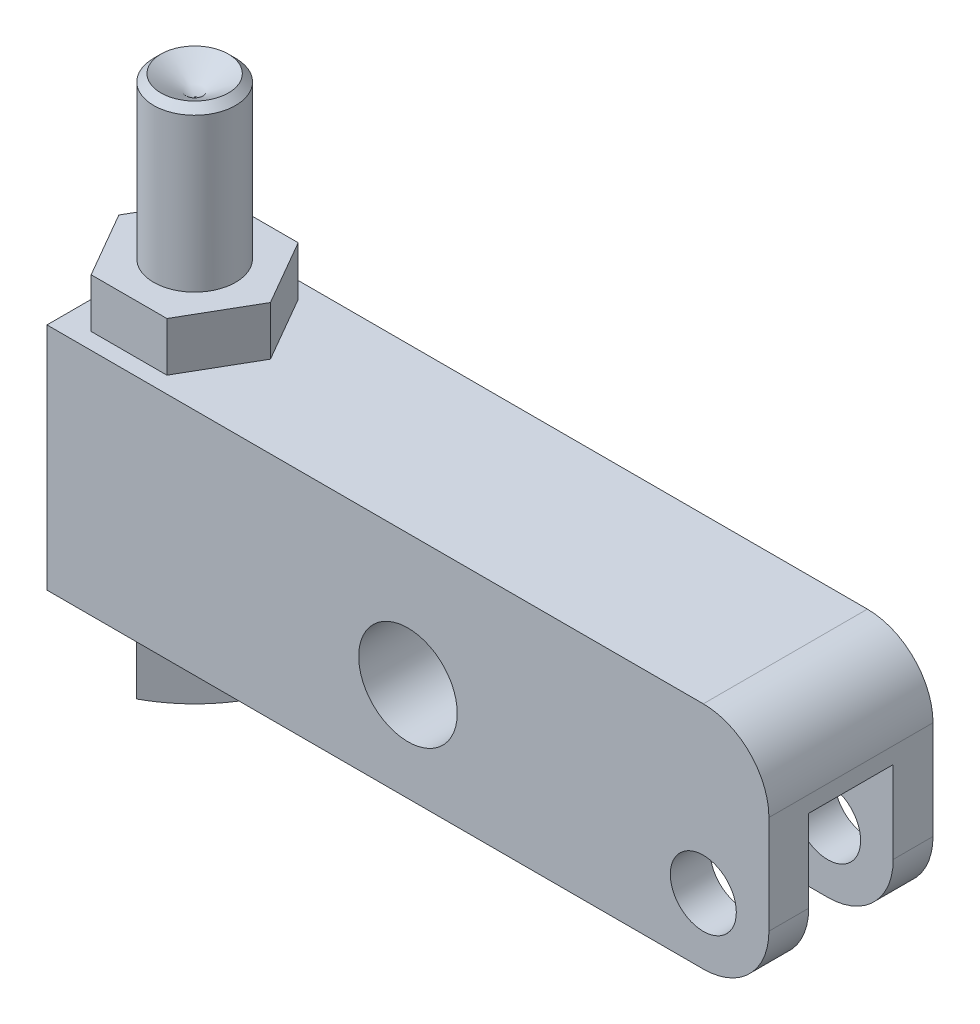
ISO-10303-21;
HEADER;
FILE_DESCRIPTION(('STEP AP214'),'2;1');
FILE_NAME('part.step','',(''),(''),'','','');
FILE_SCHEMA(('AUTOMOTIVE_DESIGN { 1 0 10303 214 1 1 1 1 }'));
ENDSEC;
DATA;
#1=APPLICATION_CONTEXT('core data for automotive mechanical design processes');
#2=APPLICATION_PROTOCOL_DEFINITION('international standard','automotive_design',2000,#1);
#3=PRODUCT_CONTEXT('',#1,'mechanical');
#4=PRODUCT('Part','Part','',(#3));
#5=PRODUCT_RELATED_PRODUCT_CATEGORY('part','',(#4));
#6=PRODUCT_DEFINITION_FORMATION('','',#4);
#7=PRODUCT_DEFINITION_CONTEXT('part definition',#1,'design');
#8=PRODUCT_DEFINITION('design','',#6,#7);
#9=PRODUCT_DEFINITION_SHAPE('','',#8);
#10=(LENGTH_UNIT() NAMED_UNIT(*) SI_UNIT(.MILLI.,.METRE.));
#11=(NAMED_UNIT(*) PLANE_ANGLE_UNIT() SI_UNIT($,.RADIAN.));
#12=(NAMED_UNIT(*) SI_UNIT($,.STERADIAN.) SOLID_ANGLE_UNIT());
#13=UNCERTAINTY_MEASURE_WITH_UNIT(LENGTH_MEASURE(1.E-05),#10,'distance_accuracy_value','');
#14=(GEOMETRIC_REPRESENTATION_CONTEXT(3) GLOBAL_UNCERTAINTY_ASSIGNED_CONTEXT((#13)) GLOBAL_UNIT_ASSIGNED_CONTEXT((#10,
#11,#12)) REPRESENTATION_CONTEXT('',''));
#15=CARTESIAN_POINT('',(0.,0.,0.));
#16=DIRECTION('',(0.,0.,1.));
#17=DIRECTION('',(1.,0.,0.));
#18=AXIS2_PLACEMENT_3D('',#15,#16,#17);
#19=CARTESIAN_POINT('',(-61.1124,-8.3058,0.));
#20=DIRECTION('',(0.,1.,0.));
#21=DIRECTION('',(-1.,0.,0.));
#22=AXIS2_PLACEMENT_3D('',#19,#20,#21);
#23=PLANE('',#22);
#24=DIRECTION('',(0.707106781186548,0.,0.707106781186547));
#25=VECTOR('',#24,1.);
#26=CARTESIAN_POINT('',(-62.7536798195471,-8.3058,0.));
#27=LINE('',#26,#25);
#28=CARTESIAN_POINT('',(-59.9518399097736,-8.3058,2.80183990977357));
#29=VERTEX_POINT('',#28);
#30=CARTESIAN_POINT('',(-57.15,-8.3058,5.60367981954715));
#31=VERTEX_POINT('',#30);
#32=EDGE_CURVE('E202',#29,#31,#27,.T.);
#33=ORIENTED_EDGE('',*,*,#32,.T.);
#34=DIRECTION('',(0.707106781186547,0.,-0.707106781186548));
#35=VECTOR('',#34,1.);
#36=CARTESIAN_POINT('',(-57.15,-8.3058,5.60367981954715));
#37=LINE('',#36,#35);
#38=CARTESIAN_POINT('',(-54.3481600902264,-8.3058,2.80183990977358));
#39=VERTEX_POINT('',#38);
#40=EDGE_CURVE('E211',#31,#39,#37,.T.);
#41=ORIENTED_EDGE('',*,*,#40,.T.);
#42=CARTESIAN_POINT('',(-57.15,-8.3058,0.));
#43=DIRECTION('',(0.,1.,0.));
#44=DIRECTION('',(-1.,0.,0.));
#45=AXIS2_PLACEMENT_3D('',#42,#43,#44);
#46=CIRCLE('',#45,3.96240000000001);
#47=EDGE_CURVE('E220',#29,#39,#46,.T.);
#48=ORIENTED_EDGE('',*,*,#47,.F.);
#49=EDGE_LOOP('',(#33,#41,#48));
#50=FACE_BOUND('',#49,.T.);
#51=ADVANCED_FACE('F35',(#50),#23,.T.);
#52=CARTESIAN_POINT('',(-54.3481600902264,-8.3058,-2.80183990977358));
#53=VERTEX_POINT('',#52);
#54=EDGE_CURVE('E234',#39,#53,#46,.T.);
#55=ORIENTED_EDGE('',*,*,#54,.F.);
#56=CARTESIAN_POINT('',(-51.5463201804528,-8.3058,0.));
#57=VERTEX_POINT('',#56);
#58=EDGE_CURVE('E214',#39,#57,#37,.T.);
#59=ORIENTED_EDGE('',*,*,#58,.T.);
#60=DIRECTION('',(-0.707106781186548,0.,-0.707106781186548));
#61=VECTOR('',#60,1.);
#62=CARTESIAN_POINT('',(-51.5463201804528,-8.3058,0.));
#63=LINE('',#62,#61);
#64=EDGE_CURVE('E414',#57,#53,#63,.T.);
#65=ORIENTED_EDGE('',*,*,#64,.T.);
#66=EDGE_LOOP('',(#55,#59,#65));
#67=FACE_BOUND('',#66,.T.);
#68=ADVANCED_FACE('F419',(#67),#23,.T.);
#69=CARTESIAN_POINT('',(-59.9518399097736,-8.3058,-2.80183990977357));
#70=VERTEX_POINT('',#69);
#71=EDGE_CURVE('E423',#53,#70,#46,.T.);
#72=ORIENTED_EDGE('',*,*,#71,.F.);
#73=CARTESIAN_POINT('',(-57.15,-8.3058,-5.60367981954715));
#74=VERTEX_POINT('',#73);
#75=EDGE_CURVE('E416',#53,#74,#63,.T.);
#76=ORIENTED_EDGE('',*,*,#75,.T.);
#77=DIRECTION('',(-0.707106781186547,0.,0.707106781186548));
#78=VECTOR('',#77,1.);
#79=CARTESIAN_POINT('',(-57.15,-8.3058,-5.60367981954715));
#80=LINE('',#79,#78);
#81=EDGE_CURVE('E221',#74,#70,#80,.T.);
#82=ORIENTED_EDGE('',*,*,#81,.T.);
#83=EDGE_LOOP('',(#72,#76,#82));
#84=FACE_BOUND('',#83,.T.);
#85=ADVANCED_FACE('F433',(#84),#23,.T.);
#86=CARTESIAN_POINT('',(-62.7536798195471,-8.3058,0.));
#87=VERTEX_POINT('',#86);
#88=EDGE_CURVE('E224',#70,#87,#80,.T.);
#89=ORIENTED_EDGE('',*,*,#88,.T.);
#90=EDGE_CURVE('E50',#87,#29,#27,.T.);
#91=ORIENTED_EDGE('',*,*,#90,.T.);
#92=EDGE_CURVE('E228',#70,#29,#46,.T.);
#93=ORIENTED_EDGE('',*,*,#92,.F.);
#94=EDGE_LOOP('',(#89,#91,#93));
#95=FACE_BOUND('',#94,.T.);
#96=ADVANCED_FACE('F430',(#95),#23,.T.);
#97=CARTESIAN_POINT('',(-63.5,15.875,7.9375));
#98=DIRECTION('',(0.,-1.,0.));
#99=DIRECTION('',(0.,0.,-1.));
#100=AXIS2_PLACEMENT_3D('',#97,#98,#99);
#101=PLANE('',#100);
#102=DIRECTION('',(-0.5,0.,0.866025403784439));
#103=VECTOR('',#102,1.);
#104=CARTESIAN_POINT('',(-60.8161742093541,15.875,-6.34999999999999));
#105=LINE('',#104,#103);
#106=CARTESIAN_POINT('',(-60.8161742093541,15.875,-6.34999999999999));
#107=VERTEX_POINT('',#106);
#108=CARTESIAN_POINT('',(-63.5,15.875,-1.70147737193761));
#109=VERTEX_POINT('',#108);
#110=EDGE_CURVE('E268',#107,#109,#105,.T.);
#111=ORIENTED_EDGE('',*,*,#110,.F.);
#112=DIRECTION('',(-1.,0.,0.));
#113=VECTOR('',#112,1.);
#114=CARTESIAN_POINT('',(-53.4838257906459,15.875,-6.34999999999999));
#115=LINE('',#114,#113);
#116=CARTESIAN_POINT('',(-53.4838257906459,15.875,-6.34999999999999));
#117=VERTEX_POINT('',#116);
#118=EDGE_CURVE('E264',#117,#107,#115,.T.);
#119=ORIENTED_EDGE('',*,*,#118,.F.);
#120=DIRECTION('',(-0.5,0.,-0.866025403784438));
#121=VECTOR('',#120,1.);
#122=CARTESIAN_POINT('',(-49.8176515812918,15.875,0.));
#123=LINE('',#122,#121);
#124=CARTESIAN_POINT('',(-49.8176515812918,15.875,0.));
#125=VERTEX_POINT('',#124);
#126=EDGE_CURVE('E261',#125,#117,#123,.T.);
#127=ORIENTED_EDGE('',*,*,#126,.F.);
#128=DIRECTION('',(0.5,0.,-0.866025403784439));
#129=VECTOR('',#128,1.);
#130=CARTESIAN_POINT('',(-53.4838257906459,15.875,6.35000000000001));
#131=LINE('',#130,#129);
#132=CARTESIAN_POINT('',(-53.4838257906459,15.875,6.35000000000001));
#133=VERTEX_POINT('',#132);
#134=EDGE_CURVE('E243',#133,#125,#131,.T.);
#135=ORIENTED_EDGE('',*,*,#134,.F.);
#136=DIRECTION('',(1.,0.,0.));
#137=VECTOR('',#136,1.);
#138=CARTESIAN_POINT('',(-60.8161742093541,15.875,6.35000000000001));
#139=LINE('',#138,#137);
#140=CARTESIAN_POINT('',(-60.8161742093541,15.875,6.35000000000001));
#141=VERTEX_POINT('',#140);
#142=EDGE_CURVE('E248',#141,#133,#139,.T.);
#143=ORIENTED_EDGE('',*,*,#142,.F.);
#144=DIRECTION('',(0.5,0.,0.866025403784439));
#145=VECTOR('',#144,1.);
#146=CARTESIAN_POINT('',(-60.7997229927617,15.875,6.37849434298441));
#147=LINE('',#146,#145);
#148=CARTESIAN_POINT('',(-63.5,15.875,1.70147737193762));
#149=VERTEX_POINT('',#148);
#150=EDGE_CURVE('E398',#149,#141,#147,.T.);
#151=ORIENTED_EDGE('',*,*,#150,.F.);
#152=DIRECTION('',(0.,0.,-1.));
#153=VECTOR('',#152,1.);
#154=CARTESIAN_POINT('',(-63.5,15.875,7.9375));
#155=LINE('',#154,#153);
#156=CARTESIAN_POINT('',(-63.5,15.875,7.9375));
#157=VERTEX_POINT('',#156);
#158=EDGE_CURVE('E360',#157,#149,#155,.T.);
#159=ORIENTED_EDGE('',*,*,#158,.F.);
#160=DIRECTION('',(-1.,0.,0.));
#161=VECTOR('',#160,1.);
#162=CARTESIAN_POINT('',(-63.5,15.875,7.9375));
#163=LINE('',#162,#161);
#164=CARTESIAN_POINT('',(0.,15.875,7.9375));
#165=VERTEX_POINT('',#164);
#166=EDGE_CURVE('E347',#165,#157,#163,.T.);
#167=ORIENTED_EDGE('',*,*,#166,.F.);
#168=DIRECTION('',(0.,0.,-1.));
#169=VECTOR('',#168,1.);
#170=CARTESIAN_POINT('',(0.,15.875,7.9375));
#171=LINE('',#170,#169);
#172=CARTESIAN_POINT('',(0.,15.875,-7.9375));
#173=VERTEX_POINT('',#172);
#174=EDGE_CURVE('E367',#165,#173,#171,.T.);
#175=ORIENTED_EDGE('',*,*,#174,.T.);
#176=DIRECTION('',(-1.,0.,0.));
#177=VECTOR('',#176,1.);
#178=CARTESIAN_POINT('',(-63.5,15.875,-7.9375));
#179=LINE('',#178,#177);
#180=CARTESIAN_POINT('',(-63.5,15.875,-7.9375));
#181=VERTEX_POINT('',#180);
#182=EDGE_CURVE('E341',#173,#181,#179,.T.);
#183=ORIENTED_EDGE('',*,*,#182,.T.);
#184=EDGE_CURVE('E349',#109,#181,#155,.T.);
#185=ORIENTED_EDGE('',*,*,#184,.F.);
#186=EDGE_LOOP('',(#111,#119,#127,#135,#143,#151,#159,#167,#175,#183,#185));
#187=FACE_BOUND('',#186,.T.);
#188=ADVANCED_FACE('F440',(#187),#101,.F.);
#189=CARTESIAN_POINT('',(0.,0.,7.9375));
#190=DIRECTION('',(0.,0.,-1.));
#191=DIRECTION('',(-1.,0.,0.));
#192=AXIS2_PLACEMENT_3D('',#189,#190,#191);
#193=CYLINDRICAL_SURFACE('',#192,3.19405);
#194=CARTESIAN_POINT('',(0.,0.,4.0894));
#195=DIRECTION('',(0.,0.,1.));
#196=DIRECTION('',(1.,0.,0.));
#197=AXIS2_PLACEMENT_3D('',#194,#195,#196);
#198=CIRCLE('',#197,3.19405);
#199=CARTESIAN_POINT('',(3.19405,0.,4.0894));
#200=VERTEX_POINT('',#199);
#201=EDGE_CURVE('E330',#200,#200,#198,.T.);
#202=ORIENTED_EDGE('',*,*,#201,.F.);
#203=EDGE_LOOP('',(#202));
#204=FACE_BOUND('',#203,.T.);
#205=CARTESIAN_POINT('',(0.,0.,7.9375));
#206=DIRECTION('',(0.,0.,1.));
#207=DIRECTION('',(1.,0.,0.));
#208=AXIS2_PLACEMENT_3D('',#205,#206,#207);
#209=CIRCLE('',#208,3.19405);
#210=CARTESIAN_POINT('',(3.19405,0.,7.9375));
#211=VERTEX_POINT('',#210);
#212=EDGE_CURVE('E331',#211,#211,#209,.T.);
#213=ORIENTED_EDGE('',*,*,#212,.T.);
#214=EDGE_LOOP('',(#213));
#215=FACE_BOUND('',#214,.T.);
#216=ADVANCED_FACE('F465',(#204,#215),#193,.F.);
#217=CARTESIAN_POINT('',(-63.5,-6.35,7.9375));
#218=DIRECTION('',(0.,0.,1.));
#219=DIRECTION('',(1.,0.,0.));
#220=AXIS2_PLACEMENT_3D('',#217,#218,#219);
#221=PLANE('',#220);
#222=ORIENTED_EDGE('',*,*,#212,.F.);
#223=EDGE_LOOP('',(#222));
#224=FACE_BOUND('',#223,.T.);
#225=DIRECTION('',(0.,1.,0.));
#226=VECTOR('',#225,1.);
#227=CARTESIAN_POINT('',(6.35,15.875,7.9375));
#228=LINE('',#227,#226);
#229=CARTESIAN_POINT('',(6.35,0.,7.9375));
#230=VERTEX_POINT('',#229);
#231=CARTESIAN_POINT('',(6.35,9.525,7.9375));
#232=VERTEX_POINT('',#231);
#233=EDGE_CURVE('E344',#230,#232,#228,.T.);
#234=ORIENTED_EDGE('',*,*,#233,.T.);
#235=CARTESIAN_POINT('',(0.,9.525,7.9375));
#236=DIRECTION('',(0.,0.,1.));
#237=DIRECTION('',(1.,0.,0.));
#238=AXIS2_PLACEMENT_3D('',#235,#236,#237);
#239=CIRCLE('',#238,6.35);
#240=EDGE_CURVE('E388',#232,#165,#239,.T.);
#241=ORIENTED_EDGE('',*,*,#240,.T.);
#242=ORIENTED_EDGE('',*,*,#166,.T.);
#243=DIRECTION('',(0.,-1.,0.));
#244=VECTOR('',#243,1.);
#245=CARTESIAN_POINT('',(-63.5,15.875,7.9375));
#246=LINE('',#245,#244);
#247=CARTESIAN_POINT('',(-63.5,-6.35,7.9375));
#248=VERTEX_POINT('',#247);
#249=EDGE_CURVE('E337',#157,#248,#246,.T.);
#250=ORIENTED_EDGE('',*,*,#249,.T.);
#251=DIRECTION('',(1.,0.,0.));
#252=VECTOR('',#251,1.);
#253=CARTESIAN_POINT('',(-63.5,-6.35,7.9375));
#254=LINE('',#253,#252);
#255=CARTESIAN_POINT('',(0.,-6.35,7.9375));
#256=VERTEX_POINT('',#255);
#257=EDGE_CURVE('E340',#248,#256,#254,.T.);
#258=ORIENTED_EDGE('',*,*,#257,.T.);
#259=CARTESIAN_POINT('',(0.,0.,7.9375));
#260=DIRECTION('',(0.,0.,1.));
#261=DIRECTION('',(1.,0.,0.));
#262=AXIS2_PLACEMENT_3D('',#259,#260,#261);
#263=CIRCLE('',#262,6.35);
#264=EDGE_CURVE('E386',#256,#230,#263,.T.);
#265=ORIENTED_EDGE('',*,*,#264,.T.);
#266=EDGE_LOOP('',(#234,#241,#242,#250,#258,#265));
#267=FACE_BOUND('',#266,.T.);
#268=CARTESIAN_POINT('',(-28.575,3.175,7.9375));
#269=DIRECTION('',(0.,0.,1.));
#270=DIRECTION('',(1.,0.,0.));
#271=AXIS2_PLACEMENT_3D('',#268,#269,#270);
#272=CIRCLE('',#271,4.76885);
#273=CARTESIAN_POINT('',(-23.80615,3.175,7.9375));
#274=VERTEX_POINT('',#273);
#275=EDGE_CURVE('E323',#274,#274,#272,.T.);
#276=ORIENTED_EDGE('',*,*,#275,.F.);
#277=EDGE_LOOP('',(#276));
#278=FACE_BOUND('',#277,.T.);
#279=ADVANCED_FACE('F476',(#224,#267,#278),#221,.T.);
#280=CARTESIAN_POINT('',(-63.5,-6.35,-7.9375));
#281=DIRECTION('',(0.,0.,1.));
#282=DIRECTION('',(1.,0.,0.));
#283=AXIS2_PLACEMENT_3D('',#280,#281,#282);
#284=PLANE('',#283);
#285=CARTESIAN_POINT('',(0.,0.,-7.9375));
#286=DIRECTION('',(0.,0.,1.));
#287=DIRECTION('',(1.,0.,0.));
#288=AXIS2_PLACEMENT_3D('',#285,#286,#287);
#289=CIRCLE('',#288,3.19405);
#290=CARTESIAN_POINT('',(3.19405,0.,-7.9375));
#291=VERTEX_POINT('',#290);
#292=EDGE_CURVE('E326',#291,#291,#289,.T.);
#293=ORIENTED_EDGE('',*,*,#292,.T.);
#294=EDGE_LOOP('',(#293));
#295=FACE_BOUND('',#294,.T.);
#296=ORIENTED_EDGE('',*,*,#182,.F.);
#297=CARTESIAN_POINT('',(0.,9.525,-7.9375));
#298=DIRECTION('',(0.,0.,1.));
#299=DIRECTION('',(1.,0.,0.));
#300=AXIS2_PLACEMENT_3D('',#297,#298,#299);
#301=CIRCLE('',#300,6.35);
#302=CARTESIAN_POINT('',(6.35,9.525,-7.9375));
#303=VERTEX_POINT('',#302);
#304=EDGE_CURVE('E376',#173,#303,#301,.F.);
#305=ORIENTED_EDGE('',*,*,#304,.T.);
#306=DIRECTION('',(0.,1.,0.));
#307=VECTOR('',#306,1.);
#308=CARTESIAN_POINT('',(6.35,15.875,-7.9375));
#309=LINE('',#308,#307);
#310=CARTESIAN_POINT('',(6.35,0.,-7.9375));
#311=VERTEX_POINT('',#310);
#312=EDGE_CURVE('E355',#311,#303,#309,.T.);
#313=ORIENTED_EDGE('',*,*,#312,.F.);
#314=CARTESIAN_POINT('',(0.,0.,-7.9375));
#315=DIRECTION('',(0.,0.,1.));
#316=DIRECTION('',(1.,0.,0.));
#317=AXIS2_PLACEMENT_3D('',#314,#315,#316);
#318=CIRCLE('',#317,6.35);
#319=CARTESIAN_POINT('',(0.,-6.35,-7.9375));
#320=VERTEX_POINT('',#319);
#321=EDGE_CURVE('E374',#311,#320,#318,.F.);
#322=ORIENTED_EDGE('',*,*,#321,.T.);
#323=DIRECTION('',(1.,0.,0.));
#324=VECTOR('',#323,1.);
#325=CARTESIAN_POINT('',(-63.5,-6.35,-7.9375));
#326=LINE('',#325,#324);
#327=CARTESIAN_POINT('',(-63.5,-6.35,-7.9375));
#328=VERTEX_POINT('',#327);
#329=EDGE_CURVE('E352',#328,#320,#326,.T.);
#330=ORIENTED_EDGE('',*,*,#329,.F.);
#331=DIRECTION('',(0.,-1.,0.));
#332=VECTOR('',#331,1.);
#333=CARTESIAN_POINT('',(-63.5,15.875,-7.9375));
#334=LINE('',#333,#332);
#335=EDGE_CURVE('E334',#181,#328,#334,.T.);
#336=ORIENTED_EDGE('',*,*,#335,.F.);
#337=EDGE_LOOP('',(#296,#305,#313,#322,#330,#336));
#338=FACE_BOUND('',#337,.T.);
#339=CARTESIAN_POINT('',(-28.575,3.175,-7.9375));
#340=DIRECTION('',(0.,0.,1.));
#341=DIRECTION('',(1.,0.,0.));
#342=AXIS2_PLACEMENT_3D('',#339,#340,#341);
#343=CIRCLE('',#342,4.76885);
#344=CARTESIAN_POINT('',(-23.80615,3.175,-7.9375));
#345=VERTEX_POINT('',#344);
#346=EDGE_CURVE('E327',#345,#345,#343,.T.);
#347=ORIENTED_EDGE('',*,*,#346,.T.);
#348=EDGE_LOOP('',(#347));
#349=FACE_BOUND('',#348,.T.);
#350=ADVANCED_FACE('F488',(#295,#338,#349),#284,.F.);
#351=CARTESIAN_POINT('',(-63.5,15.875,7.9375));
#352=DIRECTION('',(1.,0.,0.));
#353=DIRECTION('',(0.,0.,-1.));
#354=AXIS2_PLACEMENT_3D('',#351,#352,#353);
#355=PLANE('',#354);
#356=ORIENTED_EDGE('',*,*,#335,.T.);
#357=DIRECTION('',(0.,0.,-1.));
#358=VECTOR('',#357,1.);
#359=CARTESIAN_POINT('',(-63.5,-6.35,7.9375));
#360=LINE('',#359,#358);
#361=EDGE_CURVE('E363',#248,#328,#360,.T.);
#362=ORIENTED_EDGE('',*,*,#361,.F.);
#363=ORIENTED_EDGE('',*,*,#249,.F.);
#364=ORIENTED_EDGE('',*,*,#158,.T.);
#365=EDGE_CURVE('E364',#149,#109,#155,.T.);
#366=ORIENTED_EDGE('',*,*,#365,.T.);
#367=ORIENTED_EDGE('',*,*,#184,.T.);
#368=EDGE_LOOP('',(#356,#362,#363,#364,#366,#367));
#369=FACE_BOUND('',#368,.T.);
#370=ADVANCED_FACE('F498',(#369),#355,.F.);
#371=CARTESIAN_POINT('',(-63.5,-6.35,7.9375));
#372=DIRECTION('',(0.,1.,0.));
#373=DIRECTION('',(0.,0.,1.));
#374=AXIS2_PLACEMENT_3D('',#371,#372,#373);
#375=PLANE('',#374);
#376=CARTESIAN_POINT('',(-57.15,-6.35,0.));
#377=DIRECTION('',(0.,1.,0.));
#378=DIRECTION('',(0.,0.,1.));
#379=AXIS2_PLACEMENT_3D('',#376,#377,#378);
#380=CIRCLE('',#379,3.96240000000001);
#381=CARTESIAN_POINT('',(-57.15,-6.35,3.96240000000001));
#382=VERTEX_POINT('',#381);
#383=EDGE_CURVE('E240',#382,#382,#380,.T.);
#384=ORIENTED_EDGE('',*,*,#383,.T.);
#385=EDGE_LOOP('',(#384));
#386=FACE_BOUND('',#385,.T.);
#387=ORIENTED_EDGE('',*,*,#329,.T.);
#388=DIRECTION('',(0.,0.,-1.));
#389=VECTOR('',#388,1.);
#390=CARTESIAN_POINT('',(0.,-6.35,7.9375));
#391=LINE('',#390,#389);
#392=CARTESIAN_POINT('',(0.,-6.35,-4.0894));
#393=VERTEX_POINT('',#392);
#394=EDGE_CURVE('E392',#320,#393,#391,.F.);
#395=ORIENTED_EDGE('',*,*,#394,.T.);
#396=DIRECTION('',(1.,0.,0.));
#397=VECTOR('',#396,1.);
#398=CARTESIAN_POINT('',(-7.9248,-6.35,-4.0894));
#399=LINE('',#398,#397);
#400=CARTESIAN_POINT('',(-7.9248,-6.35,-4.0894));
#401=VERTEX_POINT('',#400);
#402=EDGE_CURVE('E308',#401,#393,#399,.T.);
#403=ORIENTED_EDGE('',*,*,#402,.F.);
#404=CARTESIAN_POINT('',(-7.9248,-6.35,0.));
#405=DIRECTION('',(0.,-1.,0.));
#406=DIRECTION('',(0.,0.,-1.));
#407=AXIS2_PLACEMENT_3D('',#404,#405,#406);
#408=CIRCLE('',#407,4.0894);
#409=CARTESIAN_POINT('',(-7.9248,-6.35,4.0894));
#410=VERTEX_POINT('',#409);
#411=EDGE_CURVE('E293',#410,#401,#408,.T.);
#412=ORIENTED_EDGE('',*,*,#411,.F.);
#413=DIRECTION('',(-1.,0.,0.));
#414=VECTOR('',#413,1.);
#415=CARTESIAN_POINT('',(-7.9248,-6.35,4.0894));
#416=LINE('',#415,#414);
#417=CARTESIAN_POINT('',(0.,-6.35,4.0894));
#418=VERTEX_POINT('',#417);
#419=EDGE_CURVE('E298',#418,#410,#416,.T.);
#420=ORIENTED_EDGE('',*,*,#419,.F.);
#421=DIRECTION('',(0.,0.,-1.));
#422=VECTOR('',#421,1.);
#423=CARTESIAN_POINT('',(0.,-6.35,7.9375));
#424=LINE('',#423,#422);
#425=EDGE_CURVE('E390',#418,#256,#424,.F.);
#426=ORIENTED_EDGE('',*,*,#425,.T.);
#427=ORIENTED_EDGE('',*,*,#257,.F.);
#428=ORIENTED_EDGE('',*,*,#361,.T.);
#429=EDGE_LOOP('',(#387,#395,#403,#412,#420,#426,#427,#428));
#430=FACE_BOUND('',#429,.T.);
#431=ADVANCED_FACE('F507',(#386,#430),#375,.F.);
#432=CARTESIAN_POINT('',(6.35,15.875,7.9375));
#433=DIRECTION('',(-1.,0.,0.));
#434=DIRECTION('',(0.,-1.,0.));
#435=AXIS2_PLACEMENT_3D('',#432,#433,#434);
#436=PLANE('',#435);
#437=ORIENTED_EDGE('',*,*,#312,.T.);
#438=DIRECTION('',(0.,0.,-1.));
#439=VECTOR('',#438,1.);
#440=CARTESIAN_POINT('',(6.35,9.525,7.9375));
#441=LINE('',#440,#439);
#442=EDGE_CURVE('E384',#303,#232,#441,.F.);
#443=ORIENTED_EDGE('',*,*,#442,.T.);
#444=ORIENTED_EDGE('',*,*,#233,.F.);
#445=DIRECTION('',(0.,0.,-1.));
#446=VECTOR('',#445,1.);
#447=CARTESIAN_POINT('',(6.35,0.,7.9375));
#448=LINE('',#447,#446);
#449=CARTESIAN_POINT('',(6.34999999999999,0.,4.0894));
#450=VERTEX_POINT('',#449);
#451=EDGE_CURVE('E378',#230,#450,#448,.T.);
#452=ORIENTED_EDGE('',*,*,#451,.T.);
#453=DIRECTION('',(0.,-1.,0.));
#454=VECTOR('',#453,1.);
#455=CARTESIAN_POINT('',(6.34999999999999,7.9502,4.0894));
#456=LINE('',#455,#454);
#457=CARTESIAN_POINT('',(6.34999999999999,7.9502,4.0894));
#458=VERTEX_POINT('',#457);
#459=EDGE_CURVE('E316',#458,#450,#456,.T.);
#460=ORIENTED_EDGE('',*,*,#459,.F.);
#461=DIRECTION('',(0.,0.,1.));
#462=VECTOR('',#461,1.);
#463=CARTESIAN_POINT('',(6.34999999999999,7.9502,4.0894));
#464=LINE('',#463,#462);
#465=CARTESIAN_POINT('',(6.35,7.9502,-4.0894));
#466=VERTEX_POINT('',#465);
#467=EDGE_CURVE('E300',#466,#458,#464,.T.);
#468=ORIENTED_EDGE('',*,*,#467,.F.);
#469=DIRECTION('',(0.,-1.,0.));
#470=VECTOR('',#469,1.);
#471=CARTESIAN_POINT('',(6.35,7.9502,-4.0894));
#472=LINE('',#471,#470);
#473=CARTESIAN_POINT('',(6.35,0.,-4.0894));
#474=VERTEX_POINT('',#473);
#475=EDGE_CURVE('E319',#466,#474,#472,.T.);
#476=ORIENTED_EDGE('',*,*,#475,.T.);
#477=DIRECTION('',(0.,0.,-1.));
#478=VECTOR('',#477,1.);
#479=CARTESIAN_POINT('',(6.35,0.,7.9375));
#480=LINE('',#479,#478);
#481=EDGE_CURVE('E381',#474,#311,#480,.T.);
#482=ORIENTED_EDGE('',*,*,#481,.T.);
#483=EDGE_LOOP('',(#437,#443,#444,#452,#460,#468,#476,#482));
#484=FACE_BOUND('',#483,.T.);
#485=ADVANCED_FACE('F517',(#484),#436,.F.);
#486=CARTESIAN_POINT('',(0.,0.,-4.0894));
#487=DIRECTION('',(0.,0.,-1.));
#488=DIRECTION('',(-1.,0.,0.));
#489=AXIS2_PLACEMENT_3D('',#486,#487,#488);
#490=CIRCLE('',#489,3.19405);
#491=CARTESIAN_POINT('',(-3.19405,0.,-4.0894));
#492=VERTEX_POINT('',#491);
#493=EDGE_CURVE('E315',#492,#492,#490,.T.);
#494=ORIENTED_EDGE('',*,*,#493,.F.);
#495=EDGE_LOOP('',(#494));
#496=FACE_BOUND('',#495,.T.);
#497=ORIENTED_EDGE('',*,*,#292,.F.);
#498=EDGE_LOOP('',(#497));
#499=FACE_BOUND('',#498,.T.);
#500=ADVANCED_FACE('F479',(#496,#499),#193,.F.);
#501=CARTESIAN_POINT('',(-28.575,3.175,7.9375));
#502=DIRECTION('',(0.,0.,-1.));
#503=DIRECTION('',(-1.,0.,0.));
#504=AXIS2_PLACEMENT_3D('',#501,#502,#503);
#505=CYLINDRICAL_SURFACE('',#504,4.76885);
#506=ORIENTED_EDGE('',*,*,#275,.T.);
#507=EDGE_LOOP('',(#506));
#508=FACE_BOUND('',#507,.T.);
#509=ORIENTED_EDGE('',*,*,#346,.F.);
#510=EDGE_LOOP('',(#509));
#511=FACE_BOUND('',#510,.T.);
#512=ADVANCED_FACE('F535',(#508,#511),#505,.F.);
#513=CARTESIAN_POINT('',(-7.9248,7.9502,0.));
#514=DIRECTION('',(0.,-1.,0.));
#515=DIRECTION('',(0.,0.,-1.));
#516=AXIS2_PLACEMENT_3D('',#513,#514,#515);
#517=CYLINDRICAL_SURFACE('',#516,4.0894);
#518=ORIENTED_EDGE('',*,*,#411,.T.);
#519=DIRECTION('',(0.,-1.,0.));
#520=VECTOR('',#519,1.);
#521=CARTESIAN_POINT('',(-7.9248,7.9502,-4.0894));
#522=LINE('',#521,#520);
#523=CARTESIAN_POINT('',(-7.9248,7.9502,-4.0894));
#524=VERTEX_POINT('',#523);
#525=EDGE_CURVE('E305',#524,#401,#522,.T.);
#526=ORIENTED_EDGE('',*,*,#525,.F.);
#527=CARTESIAN_POINT('',(-7.9248,7.9502,0.));
#528=DIRECTION('',(0.,-1.,0.));
#529=DIRECTION('',(0.,0.,-1.));
#530=AXIS2_PLACEMENT_3D('',#527,#528,#529);
#531=CIRCLE('',#530,4.0894);
#532=CARTESIAN_POINT('',(-7.9248,7.9502,4.0894));
#533=VERTEX_POINT('',#532);
#534=EDGE_CURVE('E294',#533,#524,#531,.T.);
#535=ORIENTED_EDGE('',*,*,#534,.F.);
#536=DIRECTION('',(0.,-1.,0.));
#537=VECTOR('',#536,1.);
#538=CARTESIAN_POINT('',(-7.9248,7.9502,4.0894));
#539=LINE('',#538,#537);
#540=EDGE_CURVE('E312',#533,#410,#539,.T.);
#541=ORIENTED_EDGE('',*,*,#540,.T.);
#542=EDGE_LOOP('',(#518,#526,#535,#541));
#543=FACE_BOUND('',#542,.T.);
#544=ADVANCED_FACE('F543',(#543),#517,.F.);
#545=CARTESIAN_POINT('',(-7.9248,7.9502,4.0894));
#546=DIRECTION('',(0.,0.,1.));
#547=DIRECTION('',(1.,0.,0.));
#548=AXIS2_PLACEMENT_3D('',#545,#546,#547);
#549=PLANE('',#548);
#550=ORIENTED_EDGE('',*,*,#201,.T.);
#551=EDGE_LOOP('',(#550));
#552=FACE_BOUND('',#551,.T.);
#553=ORIENTED_EDGE('',*,*,#459,.T.);
#554=CARTESIAN_POINT('',(0.,0.,4.0894));
#555=DIRECTION('',(0.,0.,1.));
#556=DIRECTION('',(1.,0.,0.));
#557=AXIS2_PLACEMENT_3D('',#554,#555,#556);
#558=CIRCLE('',#557,6.35);
#559=EDGE_CURVE('E396',#450,#418,#558,.F.);
#560=ORIENTED_EDGE('',*,*,#559,.T.);
#561=ORIENTED_EDGE('',*,*,#419,.T.);
#562=ORIENTED_EDGE('',*,*,#540,.F.);
#563=DIRECTION('',(-1.,0.,0.));
#564=VECTOR('',#563,1.);
#565=CARTESIAN_POINT('',(-7.9248,7.9502,4.0894));
#566=LINE('',#565,#564);
#567=EDGE_CURVE('E302',#458,#533,#566,.T.);
#568=ORIENTED_EDGE('',*,*,#567,.F.);
#569=EDGE_LOOP('',(#553,#560,#561,#562,#568));
#570=FACE_BOUND('',#569,.T.);
#571=ADVANCED_FACE('F551',(#552,#570),#549,.F.);
#572=CARTESIAN_POINT('',(-7.9248,7.9502,-4.0894));
#573=DIRECTION('',(0.,0.,-1.));
#574=DIRECTION('',(-1.,0.,0.));
#575=AXIS2_PLACEMENT_3D('',#572,#573,#574);
#576=PLANE('',#575);
#577=ORIENTED_EDGE('',*,*,#493,.T.);
#578=EDGE_LOOP('',(#577));
#579=FACE_BOUND('',#578,.T.);
#580=ORIENTED_EDGE('',*,*,#402,.T.);
#581=CARTESIAN_POINT('',(0.,0.,-4.0894));
#582=DIRECTION('',(0.,0.,-1.));
#583=DIRECTION('',(-1.,0.,0.));
#584=AXIS2_PLACEMENT_3D('',#581,#582,#583);
#585=CIRCLE('',#584,6.35);
#586=EDGE_CURVE('E394',#393,#474,#585,.F.);
#587=ORIENTED_EDGE('',*,*,#586,.T.);
#588=ORIENTED_EDGE('',*,*,#475,.F.);
#589=DIRECTION('',(1.,0.,0.));
#590=VECTOR('',#589,1.);
#591=CARTESIAN_POINT('',(-7.9248,7.9502,-4.0894));
#592=LINE('',#591,#590);
#593=EDGE_CURVE('E297',#524,#466,#592,.T.);
#594=ORIENTED_EDGE('',*,*,#593,.F.);
#595=ORIENTED_EDGE('',*,*,#525,.T.);
#596=EDGE_LOOP('',(#580,#587,#588,#594,#595));
#597=FACE_BOUND('',#596,.T.);
#598=ADVANCED_FACE('F559',(#579,#597),#576,.F.);
#599=CARTESIAN_POINT('',(-7.9248,7.9502,0.));
#600=DIRECTION('',(0.,-1.,0.));
#601=DIRECTION('',(0.,0.,-1.));
#602=AXIS2_PLACEMENT_3D('',#599,#600,#601);
#603=PLANE('',#602);
#604=ORIENTED_EDGE('',*,*,#534,.T.);
#605=ORIENTED_EDGE('',*,*,#593,.T.);
#606=ORIENTED_EDGE('',*,*,#467,.T.);
#607=ORIENTED_EDGE('',*,*,#567,.T.);
#608=EDGE_LOOP('',(#604,#605,#606,#607));
#609=FACE_BOUND('',#608,.T.);
#610=ADVANCED_FACE('F568',(#609),#603,.T.);
#611=CARTESIAN_POINT('',(0.,9.525,7.9375));
#612=DIRECTION('',(0.,0.,-1.));
#613=DIRECTION('',(-1.,0.,0.));
#614=AXIS2_PLACEMENT_3D('',#611,#612,#613);
#615=CYLINDRICAL_SURFACE('',#614,6.35);
#616=ORIENTED_EDGE('',*,*,#240,.F.);
#617=ORIENTED_EDGE('',*,*,#442,.F.);
#618=ORIENTED_EDGE('',*,*,#304,.F.);
#619=ORIENTED_EDGE('',*,*,#174,.F.);
#620=EDGE_LOOP('',(#616,#617,#618,#619));
#621=FACE_BOUND('',#620,.T.);
#622=ADVANCED_FACE('F577',(#621),#615,.T.);
#623=CARTESIAN_POINT('',(0.,0.,7.9375));
#624=DIRECTION('',(0.,0.,-1.));
#625=DIRECTION('',(-1.,0.,0.));
#626=AXIS2_PLACEMENT_3D('',#623,#624,#625);
#627=CYLINDRICAL_SURFACE('',#626,6.35);
#628=ORIENTED_EDGE('',*,*,#586,.F.);
#629=ORIENTED_EDGE('',*,*,#394,.F.);
#630=ORIENTED_EDGE('',*,*,#321,.F.);
#631=ORIENTED_EDGE('',*,*,#481,.F.);
#632=EDGE_LOOP('',(#628,#629,#630,#631));
#633=FACE_BOUND('',#632,.T.);
#634=ADVANCED_FACE('F585',(#633),#627,.T.);
#635=CARTESIAN_POINT('',(0.,0.,7.9375));
#636=DIRECTION('',(0.,0.,-1.));
#637=DIRECTION('',(-1.,0.,0.));
#638=AXIS2_PLACEMENT_3D('',#635,#636,#637);
#639=CYLINDRICAL_SURFACE('',#638,6.35);
#640=ORIENTED_EDGE('',*,*,#264,.F.);
#641=ORIENTED_EDGE('',*,*,#425,.F.);
#642=ORIENTED_EDGE('',*,*,#559,.F.);
#643=ORIENTED_EDGE('',*,*,#451,.F.);
#644=EDGE_LOOP('',(#640,#641,#642,#643));
#645=FACE_BOUND('',#644,.T.);
#646=ADVANCED_FACE('F37',(#645),#639,.T.);
#647=CARTESIAN_POINT('',(-49.8176515812918,15.875,0.));
#648=DIRECTION('',(0.,1.,0.));
#649=DIRECTION('',(0.,0.,1.));
#650=AXIS2_PLACEMENT_3D('',#647,#648,#649);
#651=PLANE('',#650);
#652=CARTESIAN_POINT('',(-64.4823484187082,15.875,0.));
#653=VERTEX_POINT('',#652);
#654=EDGE_CURVE('E267',#109,#653,#105,.T.);
#655=ORIENTED_EDGE('',*,*,#654,.F.);
#656=ORIENTED_EDGE('',*,*,#365,.F.);
#657=DIRECTION('',(0.5,0.,0.866025403784439));
#658=VECTOR('',#657,1.);
#659=CARTESIAN_POINT('',(-64.4823484187082,15.875,0.));
#660=LINE('',#659,#658);
#661=EDGE_CURVE('E271',#653,#149,#660,.T.);
#662=ORIENTED_EDGE('',*,*,#661,.F.);
#663=EDGE_LOOP('',(#655,#656,#662));
#664=FACE_BOUND('',#663,.T.);
#665=ADVANCED_FACE('F600',(#664),#651,.F.);
#666=CARTESIAN_POINT('',(-53.4838257906459,20.6248,6.35000000000001));
#667=DIRECTION('',(-0.866025403784439,0.,-0.5));
#668=DIRECTION('',(-0.5,0.,0.866025403784439));
#669=AXIS2_PLACEMENT_3D('',#666,#667,#668);
#670=PLANE('',#669);
#671=ORIENTED_EDGE('',*,*,#134,.T.);
#672=DIRECTION('',(0.,-1.,0.));
#673=VECTOR('',#672,1.);
#674=CARTESIAN_POINT('',(-49.8176515812918,20.6248,0.));
#675=LINE('',#674,#673);
#676=CARTESIAN_POINT('',(-49.8176515812918,20.6248,0.));
#677=VERTEX_POINT('',#676);
#678=EDGE_CURVE('E290',#677,#125,#675,.T.);
#679=ORIENTED_EDGE('',*,*,#678,.F.);
#680=DIRECTION('',(0.5,0.,-0.866025403784439));
#681=VECTOR('',#680,1.);
#682=CARTESIAN_POINT('',(-53.4838257906459,20.6248,6.35000000000001));
#683=LINE('',#682,#681);
#684=CARTESIAN_POINT('',(-53.4838257906459,20.6248,6.35000000000001));
#685=VERTEX_POINT('',#684);
#686=EDGE_CURVE('E244',#685,#677,#683,.T.);
#687=ORIENTED_EDGE('',*,*,#686,.F.);
#688=DIRECTION('',(0.,-1.,0.));
#689=VECTOR('',#688,1.);
#690=CARTESIAN_POINT('',(-53.4838257906459,20.6248,6.35000000000001));
#691=LINE('',#690,#689);
#692=EDGE_CURVE('E258',#685,#133,#691,.T.);
#693=ORIENTED_EDGE('',*,*,#692,.T.);
#694=EDGE_LOOP('',(#671,#679,#687,#693));
#695=FACE_BOUND('',#694,.T.);
#696=ADVANCED_FACE('F607',(#695),#670,.F.);
#697=CARTESIAN_POINT('',(-49.8176515812918,20.6248,0.));
#698=DIRECTION('',(-0.866025403784439,0.,0.5));
#699=DIRECTION('',(0.5,0.,0.866025403784439));
#700=AXIS2_PLACEMENT_3D('',#697,#698,#699);
#701=PLANE('',#700);
#702=ORIENTED_EDGE('',*,*,#126,.T.);
#703=DIRECTION('',(0.,-1.,0.));
#704=VECTOR('',#703,1.);
#705=CARTESIAN_POINT('',(-53.4838257906459,20.6248,-6.34999999999999));
#706=LINE('',#705,#704);
#707=CARTESIAN_POINT('',(-53.4838257906459,20.6248,-6.34999999999999));
#708=VERTEX_POINT('',#707);
#709=EDGE_CURVE('E287',#708,#117,#706,.T.);
#710=ORIENTED_EDGE('',*,*,#709,.F.);
#711=DIRECTION('',(-0.5,0.,-0.866025403784438));
#712=VECTOR('',#711,1.);
#713=CARTESIAN_POINT('',(-49.8176515812918,20.6248,0.));
#714=LINE('',#713,#712);
#715=EDGE_CURVE('E247',#677,#708,#714,.T.);
#716=ORIENTED_EDGE('',*,*,#715,.F.);
#717=ORIENTED_EDGE('',*,*,#678,.T.);
#718=EDGE_LOOP('',(#702,#710,#716,#717));
#719=FACE_BOUND('',#718,.T.);
#720=ADVANCED_FACE('F616',(#719),#701,.F.);
#721=CARTESIAN_POINT('',(-53.4838257906459,20.6248,-6.34999999999999));
#722=DIRECTION('',(0.,0.,1.));
#723=DIRECTION('',(1.,0.,0.));
#724=AXIS2_PLACEMENT_3D('',#721,#722,#723);
#725=PLANE('',#724);
#726=ORIENTED_EDGE('',*,*,#118,.T.);
#727=DIRECTION('',(0.,-1.,0.));
#728=VECTOR('',#727,1.);
#729=CARTESIAN_POINT('',(-60.8161742093541,20.6248,-6.34999999999999));
#730=LINE('',#729,#728);
#731=CARTESIAN_POINT('',(-60.8161742093541,20.6248,-6.34999999999999));
#732=VERTEX_POINT('',#731);
#733=EDGE_CURVE('E284',#732,#107,#730,.T.);
#734=ORIENTED_EDGE('',*,*,#733,.F.);
#735=DIRECTION('',(-1.,0.,0.));
#736=VECTOR('',#735,1.);
#737=CARTESIAN_POINT('',(-53.4838257906459,20.6248,-6.34999999999999));
#738=LINE('',#737,#736);
#739=EDGE_CURVE('E250',#708,#732,#738,.T.);
#740=ORIENTED_EDGE('',*,*,#739,.F.);
#741=ORIENTED_EDGE('',*,*,#709,.T.);
#742=EDGE_LOOP('',(#726,#734,#740,#741));
#743=FACE_BOUND('',#742,.T.);
#744=ADVANCED_FACE('F625',(#743),#725,.F.);
#745=CARTESIAN_POINT('',(-60.8161742093541,20.6248,-6.34999999999999));
#746=DIRECTION('',(0.866025403784439,0.,0.5));
#747=DIRECTION('',(0.5,0.,-0.866025403784439));
#748=AXIS2_PLACEMENT_3D('',#745,#746,#747);
#749=PLANE('',#748);
#750=ORIENTED_EDGE('',*,*,#110,.T.);
#751=ORIENTED_EDGE('',*,*,#654,.T.);
#752=DIRECTION('',(0.,-1.,0.));
#753=VECTOR('',#752,1.);
#754=CARTESIAN_POINT('',(-64.4823484187082,20.6248,0.));
#755=LINE('',#754,#753);
#756=CARTESIAN_POINT('',(-64.4823484187082,20.6248,0.));
#757=VERTEX_POINT('',#756);
#758=EDGE_CURVE('E281',#757,#653,#755,.T.);
#759=ORIENTED_EDGE('',*,*,#758,.F.);
#760=DIRECTION('',(-0.5,0.,0.866025403784439));
#761=VECTOR('',#760,1.);
#762=CARTESIAN_POINT('',(-60.8161742093541,20.6248,-6.34999999999999));
#763=LINE('',#762,#761);
#764=EDGE_CURVE('E252',#732,#757,#763,.T.);
#765=ORIENTED_EDGE('',*,*,#764,.F.);
#766=ORIENTED_EDGE('',*,*,#733,.T.);
#767=EDGE_LOOP('',(#750,#751,#759,#765,#766));
#768=FACE_BOUND('',#767,.T.);
#769=ADVANCED_FACE('F634',(#768),#749,.F.);
#770=CARTESIAN_POINT('',(-64.4823484187082,20.6248,0.));
#771=DIRECTION('',(0.866025403784439,0.,-0.5));
#772=DIRECTION('',(-0.5,0.,-0.866025403784439));
#773=AXIS2_PLACEMENT_3D('',#770,#771,#772);
#774=PLANE('',#773);
#775=ORIENTED_EDGE('',*,*,#661,.T.);
#776=ORIENTED_EDGE('',*,*,#150,.T.);
#777=DIRECTION('',(0.,-1.,0.));
#778=VECTOR('',#777,1.);
#779=CARTESIAN_POINT('',(-60.8161742093541,20.6248,6.35000000000001));
#780=LINE('',#779,#778);
#781=CARTESIAN_POINT('',(-60.8161742093541,20.6248,6.35000000000001));
#782=VERTEX_POINT('',#781);
#783=EDGE_CURVE('E278',#782,#141,#780,.T.);
#784=ORIENTED_EDGE('',*,*,#783,.F.);
#785=DIRECTION('',(0.5,0.,0.866025403784439));
#786=VECTOR('',#785,1.);
#787=CARTESIAN_POINT('',(-64.4823484187082,20.6248,0.));
#788=LINE('',#787,#786);
#789=EDGE_CURVE('E254',#757,#782,#788,.T.);
#790=ORIENTED_EDGE('',*,*,#789,.F.);
#791=ORIENTED_EDGE('',*,*,#758,.T.);
#792=EDGE_LOOP('',(#775,#776,#784,#790,#791));
#793=FACE_BOUND('',#792,.T.);
#794=ADVANCED_FACE('F643',(#793),#774,.F.);
#795=CARTESIAN_POINT('',(-60.8161742093541,20.6248,6.35000000000001));
#796=DIRECTION('',(0.,0.,-1.));
#797=DIRECTION('',(-1.,0.,0.));
#798=AXIS2_PLACEMENT_3D('',#795,#796,#797);
#799=PLANE('',#798);
#800=ORIENTED_EDGE('',*,*,#142,.T.);
#801=ORIENTED_EDGE('',*,*,#692,.F.);
#802=DIRECTION('',(1.,0.,0.));
#803=VECTOR('',#802,1.);
#804=CARTESIAN_POINT('',(-60.8161742093541,20.6248,6.35000000000001));
#805=LINE('',#804,#803);
#806=EDGE_CURVE('E256',#782,#685,#805,.T.);
#807=ORIENTED_EDGE('',*,*,#806,.F.);
#808=ORIENTED_EDGE('',*,*,#783,.T.);
#809=EDGE_LOOP('',(#800,#801,#807,#808));
#810=FACE_BOUND('',#809,.T.);
#811=ADVANCED_FACE('F652',(#810),#799,.F.);
#812=CARTESIAN_POINT('',(-49.8176515812918,20.6248,0.));
#813=DIRECTION('',(0.,1.,0.));
#814=DIRECTION('',(0.,0.,1.));
#815=AXIS2_PLACEMENT_3D('',#812,#813,#814);
#816=PLANE('',#815);
#817=CARTESIAN_POINT('',(-57.15,20.6248,0.));
#818=DIRECTION('',(0.,1.,0.));
#819=DIRECTION('',(0.,0.,1.));
#820=AXIS2_PLACEMENT_3D('',#817,#818,#819);
#821=CIRCLE('',#820,3.96240000000001);
#822=CARTESIAN_POINT('',(-57.15,20.6248,3.96240000000001));
#823=VERTEX_POINT('',#822);
#824=EDGE_CURVE('E401',#823,#823,#821,.T.);
#825=ORIENTED_EDGE('',*,*,#824,.F.);
#826=EDGE_LOOP('',(#825));
#827=FACE_BOUND('',#826,.T.);
#828=ORIENTED_EDGE('',*,*,#686,.T.);
#829=ORIENTED_EDGE('',*,*,#715,.T.);
#830=ORIENTED_EDGE('',*,*,#739,.T.);
#831=ORIENTED_EDGE('',*,*,#764,.T.);
#832=ORIENTED_EDGE('',*,*,#789,.T.);
#833=ORIENTED_EDGE('',*,*,#806,.T.);
#834=EDGE_LOOP('',(#828,#829,#830,#831,#832,#833));
#835=FACE_BOUND('',#834,.T.);
#836=ADVANCED_FACE('F660',(#827,#835),#816,.T.);
#837=CARTESIAN_POINT('',(-57.15,34.1830510255559,0.));
#838=DIRECTION('',(0.,1.,0.));
#839=DIRECTION('',(-1.,0.,0.));
#840=AXIS2_PLACEMENT_3D('',#837,#838,#839);
#841=CONICAL_SURFACE('',#840,0.,1.02974425867665);
#842=CARTESIAN_POINT('',(-57.15,36.1442,0.));
#843=DIRECTION('',(0.,1.,0.));
#844=DIRECTION('',(-1.,0.,0.));
#845=AXIS2_PLACEMENT_3D('',#842,#843,#844);
#846=CIRCLE('',#845,3.26390000000001);
#847=CARTESIAN_POINT('',(-60.4139,36.1442,0.));
#848=VERTEX_POINT('',#847);
#849=EDGE_CURVE('E237',#848,#848,#846,.T.);
#850=ORIENTED_EDGE('',*,*,#849,.T.);
#851=EDGE_LOOP('',(#850));
#852=FACE_BOUND('',#851,.T.);
#853=CARTESIAN_POINT('',(-57.15,34.1830510255559,0.));
#854=VERTEX_POINT('',#853);
#855=VERTEX_LOOP('',#854);
#856=FACE_BOUND('',#855,.T.);
#857=ADVANCED_FACE('F668',(#852,#856),#841,.F.);
#858=CARTESIAN_POINT('',(-57.15,36.1442,0.));
#859=DIRECTION('',(0.,-1.,0.));
#860=DIRECTION('',(1.,0.,0.));
#861=AXIS2_PLACEMENT_3D('',#858,#859,#860);
#862=CONICAL_SURFACE('',#861,3.26390000000001,0.785398163397448);
#863=CARTESIAN_POINT('',(-57.15,35.4457,0.));
#864=DIRECTION('',(0.,1.,0.));
#865=DIRECTION('',(-1.,0.,0.));
#866=AXIS2_PLACEMENT_3D('',#863,#864,#865);
#867=CIRCLE('',#866,3.96240000000001);
#868=CARTESIAN_POINT('',(-61.1124,35.4457,0.));
#869=VERTEX_POINT('',#868);
#870=EDGE_CURVE('E233',#869,#869,#867,.T.);
#871=ORIENTED_EDGE('',*,*,#870,.T.);
#872=EDGE_LOOP('',(#871));
#873=FACE_BOUND('',#872,.T.);
#874=ORIENTED_EDGE('',*,*,#849,.F.);
#875=EDGE_LOOP('',(#874));
#876=FACE_BOUND('',#875,.T.);
#877=ADVANCED_FACE('F677',(#873,#876),#862,.T.);
#878=CARTESIAN_POINT('',(-57.15,26.5852185637721,0.));
#879=DIRECTION('',(0.,1.,0.));
#880=DIRECTION('',(-1.,0.,0.));
#881=AXIS2_PLACEMENT_3D('',#878,#879,#880);
#882=CYLINDRICAL_SURFACE('',#881,3.96240000000001);
#883=ORIENTED_EDGE('',*,*,#824,.T.);
#884=EDGE_LOOP('',(#883));
#885=FACE_BOUND('',#884,.T.);
#886=ORIENTED_EDGE('',*,*,#870,.F.);
#887=EDGE_LOOP('',(#886));
#888=FACE_BOUND('',#887,.T.);
#889=ADVANCED_FACE('F686',(#885,#888),#882,.T.);
#890=ORIENTED_EDGE('',*,*,#47,.T.);
#891=ORIENTED_EDGE('',*,*,#54,.T.);
#892=ORIENTED_EDGE('',*,*,#71,.T.);
#893=ORIENTED_EDGE('',*,*,#92,.T.);
#894=EDGE_LOOP('',(#890,#891,#892,#893));
#895=FACE_BOUND('',#894,.T.);
#896=ORIENTED_EDGE('',*,*,#383,.F.);
#897=EDGE_LOOP('',(#896));
#898=FACE_BOUND('',#897,.T.);
#899=ADVANCED_FACE('F425',(#895,#898),#882,.T.);
#900=CARTESIAN_POINT('',(-51.5463201804528,-14.2748,0.));
#901=DIRECTION('',(0.707106781186548,0.,-0.707106781186548));
#902=DIRECTION('',(-0.707106781186548,0.,-0.707106781186548));
#903=AXIS2_PLACEMENT_3D('',#900,#901,#902);
#904=PLANE('',#903);
#905=DIRECTION('',(0.,1.,0.));
#906=VECTOR('',#905,1.);
#907=CARTESIAN_POINT('',(-57.15,-14.2748,-5.60367981954715));
#908=LINE('',#907,#906);
#909=CARTESIAN_POINT('',(-57.15,-13.4658028279743,-5.60367981954715));
#910=VERTEX_POINT('',#909);
#911=EDGE_CURVE('E58',#910,#74,#908,.T.);
#912=ORIENTED_EDGE('',*,*,#911,.T.);
#913=ORIENTED_EDGE('',*,*,#75,.F.);
#914=ORIENTED_EDGE('',*,*,#64,.F.);
#915=DIRECTION('',(0.,1.,0.));
#916=VECTOR('',#915,1.);
#917=CARTESIAN_POINT('',(-51.5463201804528,-14.2748,0.));
#918=LINE('',#917,#916);
#919=CARTESIAN_POINT('',(-51.5463201804528,-13.4658028279743,0.));
#920=VERTEX_POINT('',#919);
#921=EDGE_CURVE('E207',#920,#57,#918,.T.);
#922=ORIENTED_EDGE('',*,*,#921,.F.);
#923=CARTESIAN_POINT('',(-54.3481600902264,5.5372,-2.80183990977358));
#924=DIRECTION('',(0.707106781186548,0.,-0.707106781186548));
#925=DIRECTION('',(-0.707106781186548,0.,-0.707106781186548));
#926=AXIS2_PLACEMENT_3D('',#923,#924,#925);
#927=CIRCLE('',#926,19.4117163136081);
#928=EDGE_CURVE('E11',#910,#920,#927,.F.);
#929=ORIENTED_EDGE('',*,*,#928,.F.);
#930=EDGE_LOOP('',(#912,#913,#914,#922,#929));
#931=FACE_BOUND('',#930,.T.);
#932=ADVANCED_FACE('F412',(#931),#904,.T.);
#933=CARTESIAN_POINT('',(-57.15,-14.2748,5.60367981954715));
#934=DIRECTION('',(0.707106781186548,0.,0.707106781186547));
#935=DIRECTION('',(0.707106781186547,0.,-0.707106781186548));
#936=AXIS2_PLACEMENT_3D('',#933,#934,#935);
#937=PLANE('',#936);
#938=ORIENTED_EDGE('',*,*,#921,.T.);
#939=ORIENTED_EDGE('',*,*,#58,.F.);
#940=ORIENTED_EDGE('',*,*,#40,.F.);
#941=DIRECTION('',(0.,1.,0.));
#942=VECTOR('',#941,1.);
#943=CARTESIAN_POINT('',(-57.15,-14.2748,5.60367981954715));
#944=LINE('',#943,#942);
#945=CARTESIAN_POINT('',(-57.15,-13.4658028279743,5.60367981954715));
#946=VERTEX_POINT('',#945);
#947=EDGE_CURVE('E198',#946,#31,#944,.T.);
#948=ORIENTED_EDGE('',*,*,#947,.F.);
#949=CARTESIAN_POINT('',(-54.3481600902264,5.5372,2.80183990977358));
#950=DIRECTION('',(0.707106781186548,0.,0.707106781186547));
#951=DIRECTION('',(0.707106781186547,0.,-0.707106781186548));
#952=AXIS2_PLACEMENT_3D('',#949,#950,#951);
#953=CIRCLE('',#952,19.4117163136081);
#954=EDGE_CURVE('E43',#920,#946,#953,.F.);
#955=ORIENTED_EDGE('',*,*,#954,.F.);
#956=EDGE_LOOP('',(#938,#939,#940,#948,#955));
#957=FACE_BOUND('',#956,.T.);
#958=ADVANCED_FACE('F212',(#957),#937,.T.);
#959=CARTESIAN_POINT('',(-62.7536798195471,-14.2748,0.));
#960=DIRECTION('',(-0.707106781186547,0.,0.707106781186548));
#961=DIRECTION('',(0.707106781186548,0.,0.707106781186547));
#962=AXIS2_PLACEMENT_3D('',#959,#960,#961);
#963=PLANE('',#962);
#964=ORIENTED_EDGE('',*,*,#947,.T.);
#965=ORIENTED_EDGE('',*,*,#32,.F.);
#966=ORIENTED_EDGE('',*,*,#90,.F.);
#967=DIRECTION('',(0.,1.,0.));
#968=VECTOR('',#967,1.);
#969=CARTESIAN_POINT('',(-62.7536798195471,-14.2748,0.));
#970=LINE('',#969,#968);
#971=CARTESIAN_POINT('',(-62.7536798195471,-13.4658028279743,0.));
#972=VERTEX_POINT('',#971);
#973=EDGE_CURVE('E208',#972,#87,#970,.T.);
#974=ORIENTED_EDGE('',*,*,#973,.F.);
#975=CARTESIAN_POINT('',(-59.9518399097736,5.5372,2.80183990977357));
#976=DIRECTION('',(-0.707106781186547,0.,0.707106781186548));
#977=DIRECTION('',(0.707106781186548,0.,0.707106781186547));
#978=AXIS2_PLACEMENT_3D('',#975,#976,#977);
#979=CIRCLE('',#978,19.4117163136081);
#980=EDGE_CURVE('E204',#946,#972,#979,.F.);
#981=ORIENTED_EDGE('',*,*,#980,.F.);
#982=EDGE_LOOP('',(#964,#965,#966,#974,#981));
#983=FACE_BOUND('',#982,.T.);
#984=ADVANCED_FACE('F200',(#983),#963,.T.);
#985=CARTESIAN_POINT('',(-57.15,-14.2748,-5.60367981954715));
#986=DIRECTION('',(-0.707106781186548,0.,-0.707106781186547));
#987=DIRECTION('',(-0.707106781186547,0.,0.707106781186548));
#988=AXIS2_PLACEMENT_3D('',#985,#986,#987);
#989=PLANE('',#988);
#990=ORIENTED_EDGE('',*,*,#973,.T.);
#991=ORIENTED_EDGE('',*,*,#88,.F.);
#992=ORIENTED_EDGE('',*,*,#81,.F.);
#993=ORIENTED_EDGE('',*,*,#911,.F.);
#994=CARTESIAN_POINT('',(-59.9518399097736,5.5372,-2.80183990977357));
#995=DIRECTION('',(-0.707106781186548,0.,-0.707106781186547));
#996=DIRECTION('',(-0.707106781186547,0.,0.707106781186548));
#997=AXIS2_PLACEMENT_3D('',#994,#995,#996);
#998=CIRCLE('',#997,19.4117163136081);
#999=EDGE_CURVE('E404',#972,#910,#998,.F.);
#1000=ORIENTED_EDGE('',*,*,#999,.F.);
#1001=EDGE_LOOP('',(#990,#991,#992,#993,#1000));
#1002=FACE_BOUND('',#1001,.T.);
#1003=ADVANCED_FACE('F431',(#1002),#989,.T.);
#1004=CARTESIAN_POINT('',(-57.15,5.5372,0.));
#1005=DIRECTION('',(0.,1.,0.));
#1006=DIRECTION('',(-1.,0.,0.));
#1007=AXIS2_PLACEMENT_3D('',#1004,#1005,#1006);
#1008=SPHERICAL_SURFACE('',#1007,19.812);
#1009=ORIENTED_EDGE('',*,*,#999,.T.);
#1010=ORIENTED_EDGE('',*,*,#928,.T.);
#1011=ORIENTED_EDGE('',*,*,#954,.T.);
#1012=ORIENTED_EDGE('',*,*,#980,.T.);
#1013=EDGE_LOOP('',(#1009,#1010,#1011,#1012));
#1014=FACE_BOUND('',#1013,.T.);
#1015=ADVANCED_FACE('F408',(#1014),#1008,.T.);
#1016=CLOSED_SHELL('',(#51,#68,#85,#96,#188,#216,#279,#350,#370,#431,#485,#500,#512,#544,#571,
#598,#610,#622,#634,#646,#665,#696,#720,#744,#769,#794,#811,#836,#857,#877,#889,#899,#932,#958,
#984,#1003,#1015));
#1017=MANIFOLD_SOLID_BREP('B2',#1016);
#1018=ADVANCED_BREP_SHAPE_REPRESENTATION('',(#18,#1017),#14);
#1019=SHAPE_DEFINITION_REPRESENTATION(#9,#1018);
ENDSEC;
END-ISO-10303-21;
